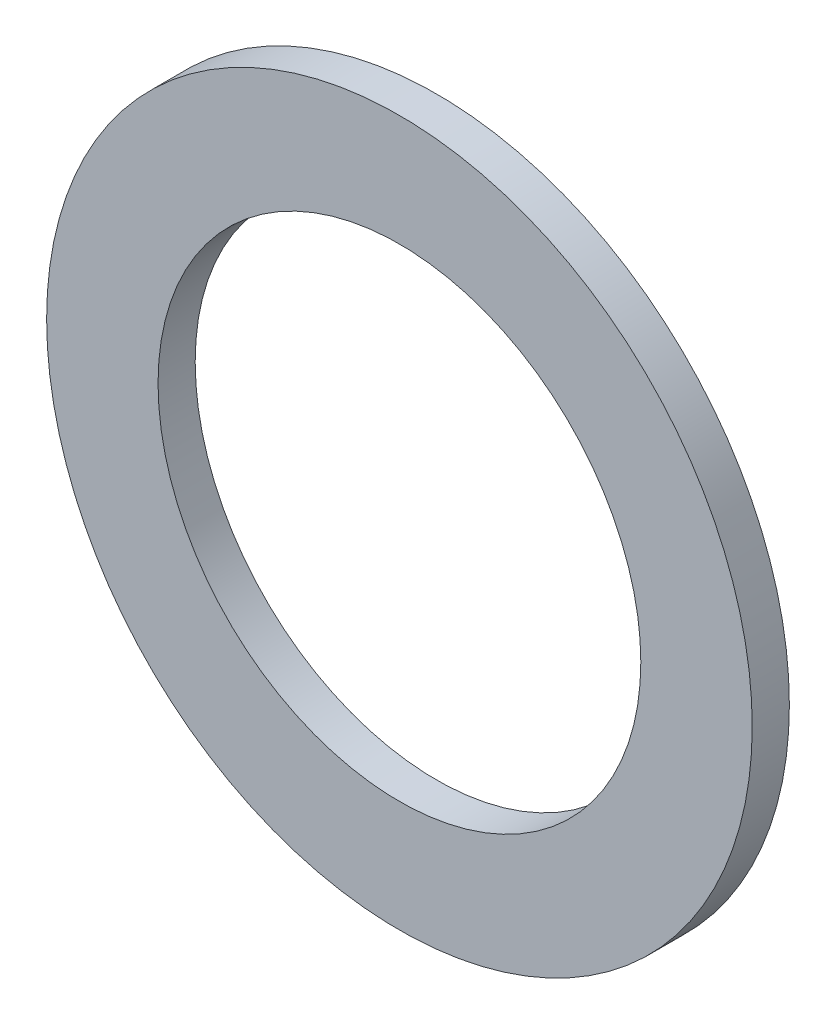
ISO-10303-21;
HEADER;
FILE_DESCRIPTION(('STEP AP214'),'2;1');
FILE_NAME('part.step','',(''),(''),'','','');
FILE_SCHEMA(('AUTOMOTIVE_DESIGN { 1 0 10303 214 1 1 1 1 }'));
ENDSEC;
DATA;
#1=APPLICATION_CONTEXT('core data for automotive mechanical design processes');
#2=APPLICATION_PROTOCOL_DEFINITION('international standard','automotive_design',2000,#1);
#3=PRODUCT_CONTEXT('',#1,'mechanical');
#4=PRODUCT('Part','Part','',(#3));
#5=PRODUCT_RELATED_PRODUCT_CATEGORY('part','',(#4));
#6=PRODUCT_DEFINITION_FORMATION('','',#4);
#7=PRODUCT_DEFINITION_CONTEXT('part definition',#1,'design');
#8=PRODUCT_DEFINITION('design','',#6,#7);
#9=PRODUCT_DEFINITION_SHAPE('','',#8);
#10=(LENGTH_UNIT() NAMED_UNIT(*) SI_UNIT(.MILLI.,.METRE.));
#11=(NAMED_UNIT(*) PLANE_ANGLE_UNIT() SI_UNIT($,.RADIAN.));
#12=(NAMED_UNIT(*) SI_UNIT($,.STERADIAN.) SOLID_ANGLE_UNIT());
#13=UNCERTAINTY_MEASURE_WITH_UNIT(LENGTH_MEASURE(1.E-05),#10,'distance_accuracy_value','');
#14=(GEOMETRIC_REPRESENTATION_CONTEXT(3) GLOBAL_UNCERTAINTY_ASSIGNED_CONTEXT((#13)) GLOBAL_UNIT_ASSIGNED_CONTEXT((#10,
#11,#12)) REPRESENTATION_CONTEXT('',''));
#15=CARTESIAN_POINT('',(0.,0.,0.));
#16=DIRECTION('',(0.,0.,1.));
#17=DIRECTION('',(1.,0.,0.));
#18=AXIS2_PLACEMENT_3D('',#15,#16,#17);
#19=CARTESIAN_POINT('',(0.,0.,0.));
#20=DIRECTION('',(0.,0.,-1.));
#21=DIRECTION('',(0.,-1.,0.));
#22=AXIS2_PLACEMENT_3D('',#19,#20,#21);
#23=PLANE('',#22);
#24=CARTESIAN_POINT('',(0.,0.,0.));
#25=DIRECTION('',(0.,0.,1.));
#26=DIRECTION('',(-1.,0.,0.));
#27=AXIS2_PLACEMENT_3D('',#24,#25,#26);
#28=CIRCLE('',#27,6.5);
#29=CARTESIAN_POINT('',(6.5,0.,0.));
#30=VERTEX_POINT('',#29);
#31=EDGE_CURVE('E56',#30,#30,#28,.T.);
#32=ORIENTED_EDGE('',*,*,#31,.T.);
#33=EDGE_LOOP('',(#32));
#34=FACE_BOUND('',#33,.T.);
#35=CARTESIAN_POINT('',(0.,0.,0.));
#36=DIRECTION('',(0.,0.,-1.));
#37=DIRECTION('',(-1.,0.,0.));
#38=AXIS2_PLACEMENT_3D('',#35,#36,#37);
#39=CIRCLE('',#38,9.5);
#40=CARTESIAN_POINT('',(9.5,0.,0.));
#41=VERTEX_POINT('',#40);
#42=EDGE_CURVE('E11',#41,#41,#39,.T.);
#43=ORIENTED_EDGE('',*,*,#42,.T.);
#44=EDGE_LOOP('',(#43));
#45=FACE_BOUND('',#44,.T.);
#46=ADVANCED_FACE('F17',(#34,#45),#23,.T.);
#47=CARTESIAN_POINT('',(0.,0.,1.));
#48=DIRECTION('',(0.,0.,-1.));
#49=DIRECTION('',(0.,-1.,0.));
#50=AXIS2_PLACEMENT_3D('',#47,#48,#49);
#51=PLANE('',#50);
#52=CARTESIAN_POINT('',(0.,0.,1.));
#53=DIRECTION('',(0.,0.,-1.));
#54=DIRECTION('',(-1.,0.,0.));
#55=AXIS2_PLACEMENT_3D('',#52,#53,#54);
#56=CIRCLE('',#55,6.5);
#57=CARTESIAN_POINT('',(6.5,0.,1.));
#58=VERTEX_POINT('',#57);
#59=EDGE_CURVE('E47',#58,#58,#56,.T.);
#60=ORIENTED_EDGE('',*,*,#59,.T.);
#61=EDGE_LOOP('',(#60));
#62=FACE_BOUND('',#61,.T.);
#63=CARTESIAN_POINT('',(0.,0.,1.));
#64=DIRECTION('',(0.,0.,-1.));
#65=DIRECTION('',(-1.,0.,0.));
#66=AXIS2_PLACEMENT_3D('',#63,#64,#65);
#67=CIRCLE('',#66,9.5);
#68=CARTESIAN_POINT('',(9.5,0.,1.));
#69=VERTEX_POINT('',#68);
#70=EDGE_CURVE('E65',#69,#69,#67,.T.);
#71=ORIENTED_EDGE('',*,*,#70,.F.);
#72=EDGE_LOOP('',(#71));
#73=FACE_BOUND('',#72,.T.);
#74=ADVANCED_FACE('F19',(#62,#73),#51,.F.);
#75=CARTESIAN_POINT('',(0.,0.,0.));
#76=DIRECTION('',(0.,0.,1.));
#77=DIRECTION('',(-1.,0.,0.));
#78=AXIS2_PLACEMENT_3D('',#75,#76,#77);
#79=CYLINDRICAL_SURFACE('',#78,9.5);
#80=ORIENTED_EDGE('',*,*,#70,.T.);
#81=DIRECTION('',(0.,0.,-1.));
#82=VECTOR('',#81,1.);
#83=CARTESIAN_POINT('',(9.5,0.,0.));
#84=LINE('',#83,#82);
#85=EDGE_CURVE('E28',#69,#41,#84,.T.);
#86=ORIENTED_EDGE('',*,*,#85,.T.);
#87=ORIENTED_EDGE('',*,*,#42,.F.);
#88=ORIENTED_EDGE('',*,*,#85,.F.);
#89=EDGE_LOOP('',(#80,#86,#87,#88));
#90=FACE_BOUND('',#89,.T.);
#91=ADVANCED_FACE('F73',(#90),#79,.T.);
#92=CARTESIAN_POINT('',(0.,0.,0.));
#93=DIRECTION('',(0.,0.,1.));
#94=DIRECTION('',(-1.,0.,0.));
#95=AXIS2_PLACEMENT_3D('',#92,#93,#94);
#96=CYLINDRICAL_SURFACE('',#95,6.5);
#97=ORIENTED_EDGE('',*,*,#31,.F.);
#98=DIRECTION('',(0.,0.,1.));
#99=VECTOR('',#98,1.);
#100=CARTESIAN_POINT('',(6.5,0.,0.));
#101=LINE('',#100,#99);
#102=EDGE_CURVE('E21',#30,#58,#101,.T.);
#103=ORIENTED_EDGE('',*,*,#102,.T.);
#104=ORIENTED_EDGE('',*,*,#59,.F.);
#105=ORIENTED_EDGE('',*,*,#102,.F.);
#106=EDGE_LOOP('',(#97,#103,#104,#105));
#107=FACE_BOUND('',#106,.T.);
#108=ADVANCED_FACE('F55',(#107),#96,.F.);
#109=CLOSED_SHELL('',(#46,#74,#91,#108));
#110=MANIFOLD_SOLID_BREP('B1',#109);
#111=ADVANCED_BREP_SHAPE_REPRESENTATION('',(#18,#110),#14);
#112=SHAPE_DEFINITION_REPRESENTATION(#9,#111);
ENDSEC;
END-ISO-10303-21;
